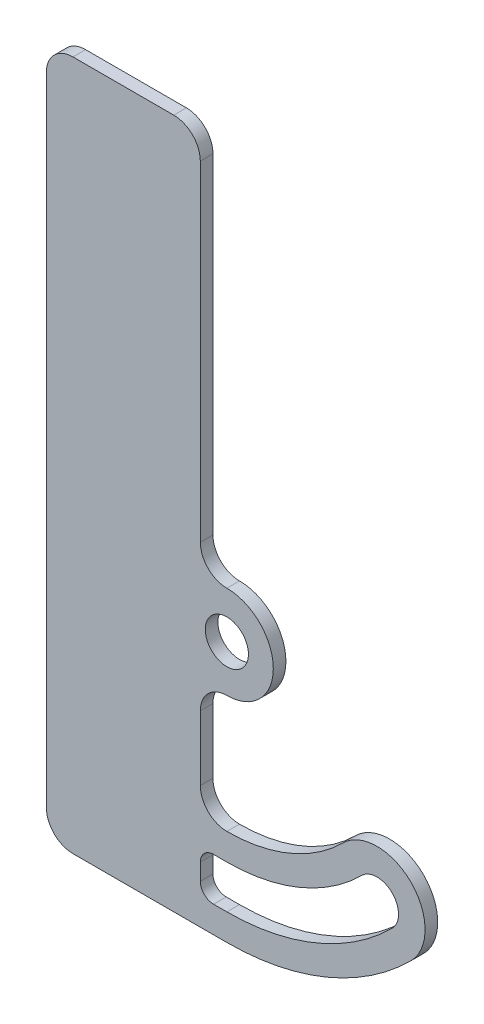
ISO-10303-21;
HEADER;
FILE_DESCRIPTION(('STEP AP214'),'2;1');
FILE_NAME('part.step','',(''),(''),'','','');
FILE_SCHEMA(('AUTOMOTIVE_DESIGN { 1 0 10303 214 1 1 1 1 }'));
ENDSEC;
DATA;
#1=APPLICATION_CONTEXT('core data for automotive mechanical design processes');
#2=APPLICATION_PROTOCOL_DEFINITION('international standard','automotive_design',2000,#1);
#3=PRODUCT_CONTEXT('',#1,'mechanical');
#4=PRODUCT('Part','Part','',(#3));
#5=PRODUCT_RELATED_PRODUCT_CATEGORY('part','',(#4));
#6=PRODUCT_DEFINITION_FORMATION('','',#4);
#7=PRODUCT_DEFINITION_CONTEXT('part definition',#1,'design');
#8=PRODUCT_DEFINITION('design','',#6,#7);
#9=PRODUCT_DEFINITION_SHAPE('','',#8);
#10=(LENGTH_UNIT() NAMED_UNIT(*) SI_UNIT(.MILLI.,.METRE.));
#11=(NAMED_UNIT(*) PLANE_ANGLE_UNIT() SI_UNIT($,.RADIAN.));
#12=(NAMED_UNIT(*) SI_UNIT($,.STERADIAN.) SOLID_ANGLE_UNIT());
#13=UNCERTAINTY_MEASURE_WITH_UNIT(LENGTH_MEASURE(1.E-05),#10,'distance_accuracy_value','');
#14=(GEOMETRIC_REPRESENTATION_CONTEXT(3) GLOBAL_UNCERTAINTY_ASSIGNED_CONTEXT((#13)) GLOBAL_UNIT_ASSIGNED_CONTEXT((#10,
#11,#12)) REPRESENTATION_CONTEXT('',''));
#15=CARTESIAN_POINT('',(0.,0.,0.));
#16=DIRECTION('',(0.,0.,1.));
#17=DIRECTION('',(1.,0.,0.));
#18=AXIS2_PLACEMENT_3D('',#15,#16,#17);
#19=CARTESIAN_POINT('',(40.005,13.49375,0.));
#20=DIRECTION('',(0.,0.,1.));
#21=DIRECTION('',(1.,0.,0.));
#22=AXIS2_PLACEMENT_3D('',#19,#20,#21);
#23=CYLINDRICAL_SURFACE('',#22,3.175);
#24=DIRECTION('',(0.,0.,-1.));
#25=VECTOR('',#24,1.);
#26=CARTESIAN_POINT('',(40.005,16.66875,0.));
#27=LINE('',#26,#25);
#28=CARTESIAN_POINT('',(40.005,16.66875,3.0226));
#29=VERTEX_POINT('',#28);
#30=CARTESIAN_POINT('',(40.005,16.66875,0.));
#31=VERTEX_POINT('',#30);
#32=EDGE_CURVE('E11',#29,#31,#27,.T.);
#33=ORIENTED_EDGE('',*,*,#32,.F.);
#34=CARTESIAN_POINT('',(40.005,13.49375,3.0226));
#35=DIRECTION('',(0.,0.,1.));
#36=DIRECTION('',(1.,0.,0.));
#37=AXIS2_PLACEMENT_3D('',#34,#35,#36);
#38=CIRCLE('',#37,3.175);
#39=CARTESIAN_POINT('',(36.83,13.49375,3.0226));
#40=VERTEX_POINT('',#39);
#41=EDGE_CURVE('E154',#29,#40,#38,.T.);
#42=ORIENTED_EDGE('',*,*,#41,.T.);
#43=DIRECTION('',(0.,0.,-1.));
#44=VECTOR('',#43,1.);
#45=CARTESIAN_POINT('',(36.83,13.49375,0.));
#46=LINE('',#45,#44);
#47=CARTESIAN_POINT('',(36.83,13.49375,0.));
#48=VERTEX_POINT('',#47);
#49=EDGE_CURVE('E51',#40,#48,#46,.T.);
#50=ORIENTED_EDGE('',*,*,#49,.T.);
#51=CARTESIAN_POINT('',(40.005,13.49375,0.));
#52=DIRECTION('',(0.,0.,1.));
#53=DIRECTION('',(1.,0.,0.));
#54=AXIS2_PLACEMENT_3D('',#51,#52,#53);
#55=CIRCLE('',#54,3.175);
#56=EDGE_CURVE('E243',#31,#48,#55,.T.);
#57=ORIENTED_EDGE('',*,*,#56,.F.);
#58=EDGE_LOOP('',(#33,#42,#50,#57));
#59=FACE_BOUND('',#58,.T.);
#60=ADVANCED_FACE('F41',(#59),#23,.F.);
#61=CARTESIAN_POINT('',(36.83,6.34999999999999,0.));
#62=DIRECTION('',(-1.,0.,0.));
#63=DIRECTION('',(0.,-1.,0.));
#64=AXIS2_PLACEMENT_3D('',#61,#62,#63);
#65=PLANE('',#64);
#66=ORIENTED_EDGE('',*,*,#49,.F.);
#67=DIRECTION('',(0.,1.,0.));
#68=VECTOR('',#67,1.);
#69=CARTESIAN_POINT('',(36.83,62.309375,3.0226));
#70=LINE('',#69,#68);
#71=CARTESIAN_POINT('',(36.83,9.52499999999998,3.0226));
#72=VERTEX_POINT('',#71);
#73=EDGE_CURVE('E178',#40,#72,#70,.F.);
#74=ORIENTED_EDGE('',*,*,#73,.T.);
#75=DIRECTION('',(0.,0.,-1.));
#76=VECTOR('',#75,1.);
#77=CARTESIAN_POINT('',(36.83,9.52499999999999,0.));
#78=LINE('',#77,#76);
#79=CARTESIAN_POINT('',(36.83,9.52499999999999,0.));
#80=VERTEX_POINT('',#79);
#81=EDGE_CURVE('E236',#72,#80,#78,.T.);
#82=ORIENTED_EDGE('',*,*,#81,.T.);
#83=DIRECTION('',(0.,-1.,0.));
#84=VECTOR('',#83,1.);
#85=CARTESIAN_POINT('',(36.83,6.34999999999999,0.));
#86=LINE('',#85,#84);
#87=EDGE_CURVE('E252',#48,#80,#86,.T.);
#88=ORIENTED_EDGE('',*,*,#87,.F.);
#89=EDGE_LOOP('',(#66,#74,#82,#88));
#90=FACE_BOUND('',#89,.T.);
#91=ADVANCED_FACE('F255',(#90),#65,.F.);
#92=CARTESIAN_POINT('',(40.005,9.52499999999999,0.));
#93=DIRECTION('',(0.,0.,1.));
#94=DIRECTION('',(1.,0.,0.));
#95=AXIS2_PLACEMENT_3D('',#92,#93,#94);
#96=CYLINDRICAL_SURFACE('',#95,3.175);
#97=ORIENTED_EDGE('',*,*,#81,.F.);
#98=CARTESIAN_POINT('',(40.005,9.52499999999999,3.0226));
#99=DIRECTION('',(0.,0.,1.));
#100=DIRECTION('',(1.,0.,0.));
#101=AXIS2_PLACEMENT_3D('',#98,#99,#100);
#102=CIRCLE('',#101,3.175);
#103=CARTESIAN_POINT('',(40.005,6.34999999999999,3.0226));
#104=VERTEX_POINT('',#103);
#105=EDGE_CURVE('E175',#72,#104,#102,.T.);
#106=ORIENTED_EDGE('',*,*,#105,.T.);
#107=DIRECTION('',(0.,0.,-1.));
#108=VECTOR('',#107,1.);
#109=CARTESIAN_POINT('',(40.005,6.34999999999999,0.));
#110=LINE('',#109,#108);
#111=CARTESIAN_POINT('',(40.005,6.34999999999999,0.));
#112=VERTEX_POINT('',#111);
#113=EDGE_CURVE('E233',#104,#112,#110,.T.);
#114=ORIENTED_EDGE('',*,*,#113,.T.);
#115=CARTESIAN_POINT('',(40.005,9.52499999999999,0.));
#116=DIRECTION('',(0.,0.,1.));
#117=DIRECTION('',(1.,0.,0.));
#118=AXIS2_PLACEMENT_3D('',#115,#116,#117);
#119=CIRCLE('',#118,3.175);
#120=EDGE_CURVE('E256',#80,#112,#119,.T.);
#121=ORIENTED_EDGE('',*,*,#120,.F.);
#122=EDGE_LOOP('',(#97,#106,#114,#121));
#123=FACE_BOUND('',#122,.T.);
#124=ADVANCED_FACE('F416',(#123),#96,.F.);
#125=CARTESIAN_POINT('',(36.83,6.34999999999999,0.));
#126=DIRECTION('',(0.,-1.,0.));
#127=DIRECTION('',(1.,0.,0.));
#128=AXIS2_PLACEMENT_3D('',#125,#126,#127);
#129=PLANE('',#128);
#130=ORIENTED_EDGE('',*,*,#113,.F.);
#131=DIRECTION('',(1.,0.,0.));
#132=VECTOR('',#131,1.);
#133=CARTESIAN_POINT('',(43.18,6.34999999999999,3.0226));
#134=LINE('',#133,#132);
#135=CARTESIAN_POINT('',(43.18,6.34999999999999,3.0226));
#136=VERTEX_POINT('',#135);
#137=EDGE_CURVE('E172',#104,#136,#134,.T.);
#138=ORIENTED_EDGE('',*,*,#137,.T.);
#139=DIRECTION('',(0.,0.,-1.));
#140=VECTOR('',#139,1.);
#141=CARTESIAN_POINT('',(43.18,6.34999999999999,0.));
#142=LINE('',#141,#140);
#143=CARTESIAN_POINT('',(43.18,6.34999999999999,0.));
#144=VERTEX_POINT('',#143);
#145=EDGE_CURVE('E230',#136,#144,#142,.T.);
#146=ORIENTED_EDGE('',*,*,#145,.T.);
#147=DIRECTION('',(1.,0.,0.));
#148=VECTOR('',#147,1.);
#149=CARTESIAN_POINT('',(36.83,6.34999999999999,0.));
#150=LINE('',#149,#148);
#151=EDGE_CURVE('E258',#112,#144,#150,.T.);
#152=ORIENTED_EDGE('',*,*,#151,.F.);
#153=EDGE_LOOP('',(#130,#138,#146,#152));
#154=FACE_BOUND('',#153,.T.);
#155=ADVANCED_FACE('F343',(#154),#129,.F.);
#156=CARTESIAN_POINT('',(43.18,62.309375,0.));
#157=DIRECTION('',(0.,0.,1.));
#158=DIRECTION('',(1.,0.,0.));
#159=AXIS2_PLACEMENT_3D('',#156,#157,#158);
#160=CYLINDRICAL_SURFACE('',#159,55.959375);
#161=ORIENTED_EDGE('',*,*,#145,.F.);
#162=CARTESIAN_POINT('',(43.18,62.309375,3.0226));
#163=DIRECTION('',(0.,0.,1.));
#164=DIRECTION('',(1.,0.,0.));
#165=AXIS2_PLACEMENT_3D('',#162,#163,#164);
#166=CIRCLE('',#165,55.959375);
#167=CARTESIAN_POINT('',(82.7492535334607,22.7401214665388,3.0226));
#168=VERTEX_POINT('',#167);
#169=EDGE_CURVE('E169',#136,#168,#166,.T.);
#170=ORIENTED_EDGE('',*,*,#169,.T.);
#171=DIRECTION('',(0.,0.,-1.));
#172=VECTOR('',#171,1.);
#173=CARTESIAN_POINT('',(82.7492535334607,22.7401214665388,0.));
#174=LINE('',#173,#172);
#175=CARTESIAN_POINT('',(82.7492535334607,22.7401214665388,0.));
#176=VERTEX_POINT('',#175);
#177=EDGE_CURVE('E228',#168,#176,#174,.T.);
#178=ORIENTED_EDGE('',*,*,#177,.T.);
#179=CARTESIAN_POINT('',(43.18,62.309375,0.));
#180=DIRECTION('',(0.,0.,1.));
#181=DIRECTION('',(1.,0.,0.));
#182=AXIS2_PLACEMENT_3D('',#179,#180,#181);
#183=CIRCLE('',#182,55.959375);
#184=EDGE_CURVE('E264',#144,#176,#183,.T.);
#185=ORIENTED_EDGE('',*,*,#184,.F.);
#186=EDGE_LOOP('',(#161,#170,#178,#185));
#187=FACE_BOUND('',#186,.T.);
#188=ADVANCED_FACE('F348',(#187),#160,.F.);
#189=CARTESIAN_POINT('',(79.1010244842764,26.3883505157232,0.));
#190=DIRECTION('',(0.,0.,1.));
#191=DIRECTION('',(1.,0.,0.));
#192=AXIS2_PLACEMENT_3D('',#189,#190,#191);
#193=CYLINDRICAL_SURFACE('',#192,5.159375);
#194=ORIENTED_EDGE('',*,*,#177,.F.);
#195=CARTESIAN_POINT('',(79.1010244842764,26.3883505157232,3.0226));
#196=DIRECTION('',(0.,0.,1.));
#197=DIRECTION('',(1.,0.,0.));
#198=AXIS2_PLACEMENT_3D('',#195,#196,#197);
#199=CIRCLE('',#198,5.159375);
#200=CARTESIAN_POINT('',(75.4527954350921,30.0365795649076,3.0226));
#201=VERTEX_POINT('',#200);
#202=EDGE_CURVE('E166',#168,#201,#199,.T.);
#203=ORIENTED_EDGE('',*,*,#202,.T.);
#204=DIRECTION('',(0.,0.,-1.));
#205=VECTOR('',#204,1.);
#206=CARTESIAN_POINT('',(75.4527954350921,30.0365795649076,0.));
#207=LINE('',#206,#205);
#208=CARTESIAN_POINT('',(75.4527954350921,30.0365795649076,0.));
#209=VERTEX_POINT('',#208);
#210=EDGE_CURVE('E59',#201,#209,#207,.T.);
#211=ORIENTED_EDGE('',*,*,#210,.T.);
#212=CARTESIAN_POINT('',(79.1010244842764,26.3883505157232,0.));
#213=DIRECTION('',(0.,0.,1.));
#214=DIRECTION('',(1.,0.,0.));
#215=AXIS2_PLACEMENT_3D('',#212,#213,#214);
#216=CIRCLE('',#215,5.159375);
#217=EDGE_CURVE('E226',#176,#209,#216,.T.);
#218=ORIENTED_EDGE('',*,*,#217,.F.);
#219=EDGE_LOOP('',(#194,#203,#211,#218));
#220=FACE_BOUND('',#219,.T.);
#221=ADVANCED_FACE('F349',(#220),#193,.F.);
#222=CARTESIAN_POINT('',(43.18,62.309375,0.));
#223=DIRECTION('',(0.,0.,1.));
#224=DIRECTION('',(1.,0.,0.));
#225=AXIS2_PLACEMENT_3D('',#222,#223,#224);
#226=CYLINDRICAL_SURFACE('',#225,45.640625);
#227=ORIENTED_EDGE('',*,*,#210,.F.);
#228=CARTESIAN_POINT('',(43.18,62.309375,3.0226));
#229=DIRECTION('',(0.,0.,-1.));
#230=DIRECTION('',(-1.,0.,0.));
#231=AXIS2_PLACEMENT_3D('',#228,#229,#230);
#232=CIRCLE('',#231,45.640625);
#233=CARTESIAN_POINT('',(43.18,16.66875,3.0226));
#234=VERTEX_POINT('',#233);
#235=EDGE_CURVE('E152',#201,#234,#232,.T.);
#236=ORIENTED_EDGE('',*,*,#235,.T.);
#237=DIRECTION('',(0.,0.,-1.));
#238=VECTOR('',#237,1.);
#239=CARTESIAN_POINT('',(43.18,16.66875,0.));
#240=LINE('',#239,#238);
#241=CARTESIAN_POINT('',(43.18,16.66875,0.));
#242=VERTEX_POINT('',#241);
#243=EDGE_CURVE('E45',#234,#242,#240,.T.);
#244=ORIENTED_EDGE('',*,*,#243,.T.);
#245=CARTESIAN_POINT('',(43.18,62.309375,0.));
#246=DIRECTION('',(0.,0.,-1.));
#247=DIRECTION('',(1.,0.,0.));
#248=AXIS2_PLACEMENT_3D('',#245,#246,#247);
#249=CIRCLE('',#248,45.640625);
#250=EDGE_CURVE('E350',#209,#242,#249,.T.);
#251=ORIENTED_EDGE('',*,*,#250,.F.);
#252=EDGE_LOOP('',(#227,#236,#244,#251));
#253=FACE_BOUND('',#252,.T.);
#254=ADVANCED_FACE('F156',(#253),#226,.T.);
#255=CARTESIAN_POINT('',(36.83,73.421875,0.));
#256=DIRECTION('',(1.,0.,0.));
#257=DIRECTION('',(0.,1.,0.));
#258=AXIS2_PLACEMENT_3D('',#255,#256,#257);
#259=PLANE('',#258);
#260=DIRECTION('',(0.,0.,-1.));
#261=VECTOR('',#260,1.);
#262=CARTESIAN_POINT('',(36.83,158.75,0.));
#263=LINE('',#262,#261);
#264=CARTESIAN_POINT('',(36.83,158.75,3.0226));
#265=VERTEX_POINT('',#264);
#266=CARTESIAN_POINT('',(36.83,158.75,0.));
#267=VERTEX_POINT('',#266);
#268=EDGE_CURVE('E147',#265,#267,#263,.T.);
#269=ORIENTED_EDGE('',*,*,#268,.F.);
#270=DIRECTION('',(0.,1.,0.));
#271=VECTOR('',#270,1.);
#272=CARTESIAN_POINT('',(36.83,62.309375,3.0226));
#273=LINE('',#272,#271);
#274=CARTESIAN_POINT('',(36.83,79.771875,3.0226));
#275=VERTEX_POINT('',#274);
#276=EDGE_CURVE('E306',#275,#265,#273,.T.);
#277=ORIENTED_EDGE('',*,*,#276,.F.);
#278=DIRECTION('',(0.,0.,-1.));
#279=VECTOR('',#278,1.);
#280=CARTESIAN_POINT('',(36.83,79.771875,0.));
#281=LINE('',#280,#279);
#282=CARTESIAN_POINT('',(36.83,79.771875,0.));
#283=VERTEX_POINT('',#282);
#284=EDGE_CURVE('E219',#275,#283,#281,.T.);
#285=ORIENTED_EDGE('',*,*,#284,.T.);
#286=DIRECTION('',(0.,1.,0.));
#287=VECTOR('',#286,1.);
#288=CARTESIAN_POINT('',(36.83,73.421875,0.));
#289=LINE('',#288,#287);
#290=EDGE_CURVE('E387',#283,#267,#289,.T.);
#291=ORIENTED_EDGE('',*,*,#290,.T.);
#292=EDGE_LOOP('',(#269,#277,#285,#291));
#293=FACE_BOUND('',#292,.T.);
#294=ADVANCED_FACE('F430',(#293),#259,.T.);
#295=CARTESIAN_POINT('',(43.18,79.771875,0.));
#296=DIRECTION('',(0.,0.,1.));
#297=DIRECTION('',(1.,0.,0.));
#298=AXIS2_PLACEMENT_3D('',#295,#296,#297);
#299=CYLINDRICAL_SURFACE('',#298,6.35);
#300=ORIENTED_EDGE('',*,*,#284,.F.);
#301=CARTESIAN_POINT('',(43.18,79.771875,3.0226));
#302=DIRECTION('',(0.,0.,1.));
#303=DIRECTION('',(1.,0.,0.));
#304=AXIS2_PLACEMENT_3D('',#301,#302,#303);
#305=CIRCLE('',#304,6.35);
#306=CARTESIAN_POINT('',(43.18,73.421875,3.0226));
#307=VERTEX_POINT('',#306);
#308=EDGE_CURVE('E304',#275,#307,#305,.T.);
#309=ORIENTED_EDGE('',*,*,#308,.T.);
#310=DIRECTION('',(0.,0.,-1.));
#311=VECTOR('',#310,1.);
#312=CARTESIAN_POINT('',(43.18,73.421875,0.));
#313=LINE('',#312,#311);
#314=CARTESIAN_POINT('',(43.18,73.421875,0.));
#315=VERTEX_POINT('',#314);
#316=EDGE_CURVE('E216',#307,#315,#313,.T.);
#317=ORIENTED_EDGE('',*,*,#316,.T.);
#318=CARTESIAN_POINT('',(43.18,79.771875,0.));
#319=DIRECTION('',(0.,0.,1.));
#320=DIRECTION('',(1.,0.,0.));
#321=AXIS2_PLACEMENT_3D('',#318,#319,#320);
#322=CIRCLE('',#321,6.35);
#323=EDGE_CURVE('E384',#283,#315,#322,.T.);
#324=ORIENTED_EDGE('',*,*,#323,.F.);
#325=EDGE_LOOP('',(#300,#309,#317,#324));
#326=FACE_BOUND('',#325,.T.);
#327=ADVANCED_FACE('F435',(#326),#299,.F.);
#328=CARTESIAN_POINT('',(43.18,62.309375,0.));
#329=DIRECTION('',(0.,0.,1.));
#330=DIRECTION('',(1.,0.,0.));
#331=AXIS2_PLACEMENT_3D('',#328,#329,#330);
#332=CYLINDRICAL_SURFACE('',#331,11.1125);
#333=ORIENTED_EDGE('',*,*,#316,.F.);
#334=CARTESIAN_POINT('',(43.18,62.309375,3.0226));
#335=DIRECTION('',(0.,0.,1.));
#336=DIRECTION('',(1.,0.,0.));
#337=AXIS2_PLACEMENT_3D('',#334,#335,#336);
#338=CIRCLE('',#337,11.1125);
#339=CARTESIAN_POINT('',(43.18,51.196875,3.0226));
#340=VERTEX_POINT('',#339);
#341=EDGE_CURVE('E301',#340,#307,#338,.T.);
#342=ORIENTED_EDGE('',*,*,#341,.F.);
#343=DIRECTION('',(0.,0.,-1.));
#344=VECTOR('',#343,1.);
#345=CARTESIAN_POINT('',(43.18,51.196875,0.));
#346=LINE('',#345,#344);
#347=CARTESIAN_POINT('',(43.18,51.196875,0.));
#348=VERTEX_POINT('',#347);
#349=EDGE_CURVE('E213',#340,#348,#346,.T.);
#350=ORIENTED_EDGE('',*,*,#349,.T.);
#351=CARTESIAN_POINT('',(43.18,62.309375,0.));
#352=DIRECTION('',(0.,0.,1.));
#353=DIRECTION('',(1.,0.,0.));
#354=AXIS2_PLACEMENT_3D('',#351,#352,#353);
#355=CIRCLE('',#354,11.1125);
#356=EDGE_CURVE('E381',#348,#315,#355,.T.);
#357=ORIENTED_EDGE('',*,*,#356,.T.);
#358=EDGE_LOOP('',(#333,#342,#350,#357));
#359=FACE_BOUND('',#358,.T.);
#360=ADVANCED_FACE('F439',(#359),#332,.T.);
#361=CARTESIAN_POINT('',(43.18,44.846875,0.));
#362=DIRECTION('',(0.,0.,1.));
#363=DIRECTION('',(1.,0.,0.));
#364=AXIS2_PLACEMENT_3D('',#361,#362,#363);
#365=CYLINDRICAL_SURFACE('',#364,6.35);
#366=ORIENTED_EDGE('',*,*,#349,.F.);
#367=CARTESIAN_POINT('',(43.18,44.846875,3.0226));
#368=DIRECTION('',(0.,0.,1.));
#369=DIRECTION('',(1.,0.,0.));
#370=AXIS2_PLACEMENT_3D('',#367,#368,#369);
#371=CIRCLE('',#370,6.35);
#372=CARTESIAN_POINT('',(36.83,44.846875,3.0226));
#373=VERTEX_POINT('',#372);
#374=EDGE_CURVE('E298',#340,#373,#371,.T.);
#375=ORIENTED_EDGE('',*,*,#374,.T.);
#376=DIRECTION('',(0.,0.,-1.));
#377=VECTOR('',#376,1.);
#378=CARTESIAN_POINT('',(36.83,44.846875,0.));
#379=LINE('',#378,#377);
#380=CARTESIAN_POINT('',(36.83,44.846875,0.));
#381=VERTEX_POINT('',#380);
#382=EDGE_CURVE('E210',#373,#381,#379,.T.);
#383=ORIENTED_EDGE('',*,*,#382,.T.);
#384=CARTESIAN_POINT('',(43.18,44.846875,0.));
#385=DIRECTION('',(0.,0.,1.));
#386=DIRECTION('',(1.,0.,0.));
#387=AXIS2_PLACEMENT_3D('',#384,#385,#386);
#388=CIRCLE('',#387,6.35);
#389=EDGE_CURVE('E378',#348,#381,#388,.T.);
#390=ORIENTED_EDGE('',*,*,#389,.F.);
#391=EDGE_LOOP('',(#366,#375,#383,#390));
#392=FACE_BOUND('',#391,.T.);
#393=ADVANCED_FACE('F443',(#392),#365,.F.);
#394=CARTESIAN_POINT('',(36.83,23.01875,0.));
#395=DIRECTION('',(1.,0.,0.));
#396=DIRECTION('',(0.,1.,0.));
#397=AXIS2_PLACEMENT_3D('',#394,#395,#396);
#398=PLANE('',#397);
#399=ORIENTED_EDGE('',*,*,#382,.F.);
#400=DIRECTION('',(0.,1.,0.));
#401=VECTOR('',#400,1.);
#402=CARTESIAN_POINT('',(36.83,62.309375,3.0226));
#403=LINE('',#402,#401);
#404=CARTESIAN_POINT('',(36.83,29.36875,3.0226));
#405=VERTEX_POINT('',#404);
#406=EDGE_CURVE('E295',#405,#373,#403,.T.);
#407=ORIENTED_EDGE('',*,*,#406,.F.);
#408=DIRECTION('',(0.,0.,-1.));
#409=VECTOR('',#408,1.);
#410=CARTESIAN_POINT('',(36.83,29.36875,0.));
#411=LINE('',#410,#409);
#412=CARTESIAN_POINT('',(36.83,29.36875,0.));
#413=VERTEX_POINT('',#412);
#414=EDGE_CURVE('E207',#405,#413,#411,.T.);
#415=ORIENTED_EDGE('',*,*,#414,.T.);
#416=DIRECTION('',(0.,1.,0.));
#417=VECTOR('',#416,1.);
#418=CARTESIAN_POINT('',(36.83,23.01875,0.));
#419=LINE('',#418,#417);
#420=EDGE_CURVE('E375',#413,#381,#419,.T.);
#421=ORIENTED_EDGE('',*,*,#420,.T.);
#422=EDGE_LOOP('',(#399,#407,#415,#421));
#423=FACE_BOUND('',#422,.T.);
#424=ADVANCED_FACE('F447',(#423),#398,.T.);
#425=CARTESIAN_POINT('',(43.18,29.36875,0.));
#426=DIRECTION('',(0.,0.,1.));
#427=DIRECTION('',(1.,0.,0.));
#428=AXIS2_PLACEMENT_3D('',#425,#426,#427);
#429=CYLINDRICAL_SURFACE('',#428,6.35);
#430=ORIENTED_EDGE('',*,*,#414,.F.);
#431=CARTESIAN_POINT('',(43.18,29.36875,3.0226));
#432=DIRECTION('',(0.,0.,1.));
#433=DIRECTION('',(1.,0.,0.));
#434=AXIS2_PLACEMENT_3D('',#431,#432,#433);
#435=CIRCLE('',#434,6.35);
#436=CARTESIAN_POINT('',(43.18,23.01875,3.0226));
#437=VERTEX_POINT('',#436);
#438=EDGE_CURVE('E292',#405,#437,#435,.T.);
#439=ORIENTED_EDGE('',*,*,#438,.T.);
#440=DIRECTION('',(0.,0.,-1.));
#441=VECTOR('',#440,1.);
#442=CARTESIAN_POINT('',(43.18,23.01875,0.));
#443=LINE('',#442,#441);
#444=CARTESIAN_POINT('',(43.18,23.01875,0.));
#445=VERTEX_POINT('',#444);
#446=EDGE_CURVE('E204',#437,#445,#443,.T.);
#447=ORIENTED_EDGE('',*,*,#446,.T.);
#448=CARTESIAN_POINT('',(43.18,29.36875,0.));
#449=DIRECTION('',(0.,0.,1.));
#450=DIRECTION('',(1.,0.,0.));
#451=AXIS2_PLACEMENT_3D('',#448,#449,#450);
#452=CIRCLE('',#451,6.35);
#453=EDGE_CURVE('E372',#413,#445,#452,.T.);
#454=ORIENTED_EDGE('',*,*,#453,.F.);
#455=EDGE_LOOP('',(#430,#439,#447,#454));
#456=FACE_BOUND('',#455,.T.);
#457=ADVANCED_FACE('F451',(#456),#429,.F.);
#458=CARTESIAN_POINT('',(43.18,62.309375,0.));
#459=DIRECTION('',(0.,0.,1.));
#460=DIRECTION('',(1.,0.,0.));
#461=AXIS2_PLACEMENT_3D('',#458,#459,#460);
#462=CYLINDRICAL_SURFACE('',#461,39.290625);
#463=ORIENTED_EDGE('',*,*,#446,.F.);
#464=CARTESIAN_POINT('',(43.18,62.309375,3.0226));
#465=DIRECTION('',(0.,0.,-1.));
#466=DIRECTION('',(-1.,0.,0.));
#467=AXIS2_PLACEMENT_3D('',#464,#465,#466);
#468=CIRCLE('',#467,39.290625);
#469=CARTESIAN_POINT('',(70.9626673745575,34.5267076254421,3.0226));
#470=VERTEX_POINT('',#469);
#471=EDGE_CURVE('E289',#470,#437,#468,.T.);
#472=ORIENTED_EDGE('',*,*,#471,.F.);
#473=DIRECTION('',(0.,0.,-1.));
#474=VECTOR('',#473,1.);
#475=CARTESIAN_POINT('',(70.9626673745575,34.5267076254421,0.));
#476=LINE('',#475,#474);
#477=CARTESIAN_POINT('',(70.9626673745575,34.5267076254421,0.));
#478=VERTEX_POINT('',#477);
#479=EDGE_CURVE('E201',#470,#478,#476,.T.);
#480=ORIENTED_EDGE('',*,*,#479,.T.);
#481=CARTESIAN_POINT('',(43.18,62.309375,0.));
#482=DIRECTION('',(0.,0.,-1.));
#483=DIRECTION('',(1.,0.,0.));
#484=AXIS2_PLACEMENT_3D('',#481,#482,#483);
#485=CIRCLE('',#484,39.290625);
#486=EDGE_CURVE('E369',#478,#445,#485,.T.);
#487=ORIENTED_EDGE('',*,*,#486,.T.);
#488=EDGE_LOOP('',(#463,#472,#480,#487));
#489=FACE_BOUND('',#488,.T.);
#490=ADVANCED_FACE('F455',(#489),#462,.F.);
#491=CARTESIAN_POINT('',(79.1010244842764,26.3883505157232,0.));
#492=DIRECTION('',(0.,0.,1.));
#493=DIRECTION('',(1.,0.,0.));
#494=AXIS2_PLACEMENT_3D('',#491,#492,#493);
#495=CYLINDRICAL_SURFACE('',#494,11.509375);
#496=ORIENTED_EDGE('',*,*,#479,.F.);
#497=CARTESIAN_POINT('',(79.1010244842764,26.3883505157232,3.0226));
#498=DIRECTION('',(0.,0.,1.));
#499=DIRECTION('',(1.,0.,0.));
#500=AXIS2_PLACEMENT_3D('',#497,#498,#499);
#501=CIRCLE('',#500,11.509375);
#502=CARTESIAN_POINT('',(87.2393815939953,18.2499934060042,3.0226));
#503=VERTEX_POINT('',#502);
#504=EDGE_CURVE('E286',#503,#470,#501,.T.);
#505=ORIENTED_EDGE('',*,*,#504,.F.);
#506=DIRECTION('',(0.,0.,-1.));
#507=VECTOR('',#506,1.);
#508=CARTESIAN_POINT('',(87.2393815939953,18.2499934060042,0.));
#509=LINE('',#508,#507);
#510=CARTESIAN_POINT('',(87.2393815939953,18.2499934060042,0.));
#511=VERTEX_POINT('',#510);
#512=EDGE_CURVE('E198',#503,#511,#509,.T.);
#513=ORIENTED_EDGE('',*,*,#512,.T.);
#514=CARTESIAN_POINT('',(79.1010244842764,26.3883505157232,0.));
#515=DIRECTION('',(0.,0.,1.));
#516=DIRECTION('',(1.,0.,0.));
#517=AXIS2_PLACEMENT_3D('',#514,#515,#516);
#518=CIRCLE('',#517,11.509375);
#519=EDGE_CURVE('E366',#511,#478,#518,.T.);
#520=ORIENTED_EDGE('',*,*,#519,.T.);
#521=EDGE_LOOP('',(#496,#505,#513,#520));
#522=FACE_BOUND('',#521,.T.);
#523=ADVANCED_FACE('F459',(#522),#495,.T.);
#524=CARTESIAN_POINT('',(43.18,62.309375,0.));
#525=DIRECTION('',(0.,0.,1.));
#526=DIRECTION('',(1.,0.,0.));
#527=AXIS2_PLACEMENT_3D('',#524,#525,#526);
#528=CYLINDRICAL_SURFACE('',#527,62.309375);
#529=ORIENTED_EDGE('',*,*,#512,.F.);
#530=CARTESIAN_POINT('',(43.18,62.309375,3.0226));
#531=DIRECTION('',(0.,0.,1.));
#532=DIRECTION('',(1.,0.,0.));
#533=AXIS2_PLACEMENT_3D('',#530,#531,#532);
#534=CIRCLE('',#533,62.309375);
#535=CARTESIAN_POINT('',(43.18,0.,3.0226));
#536=VERTEX_POINT('',#535);
#537=EDGE_CURVE('E283',#536,#503,#534,.T.);
#538=ORIENTED_EDGE('',*,*,#537,.F.);
#539=DIRECTION('',(0.,0.,-1.));
#540=VECTOR('',#539,1.);
#541=CARTESIAN_POINT('',(43.18,0.,0.));
#542=LINE('',#541,#540);
#543=CARTESIAN_POINT('',(43.18,0.,0.));
#544=VERTEX_POINT('',#543);
#545=EDGE_CURVE('E195',#536,#544,#542,.T.);
#546=ORIENTED_EDGE('',*,*,#545,.T.);
#547=CARTESIAN_POINT('',(43.18,62.309375,0.));
#548=DIRECTION('',(0.,0.,1.));
#549=DIRECTION('',(1.,0.,0.));
#550=AXIS2_PLACEMENT_3D('',#547,#548,#549);
#551=CIRCLE('',#550,62.309375);
#552=EDGE_CURVE('E363',#544,#511,#551,.T.);
#553=ORIENTED_EDGE('',*,*,#552,.T.);
#554=EDGE_LOOP('',(#529,#538,#546,#553));
#555=FACE_BOUND('',#554,.T.);
#556=ADVANCED_FACE('F463',(#555),#528,.T.);
#557=CARTESIAN_POINT('',(0.,0.,0.));
#558=DIRECTION('',(0.,-1.,0.));
#559=DIRECTION('',(1.,0.,0.));
#560=AXIS2_PLACEMENT_3D('',#557,#558,#559);
#561=PLANE('',#560);
#562=ORIENTED_EDGE('',*,*,#545,.F.);
#563=DIRECTION('',(1.,0.,0.));
#564=VECTOR('',#563,1.);
#565=CARTESIAN_POINT('',(43.18,0.,3.0226));
#566=LINE('',#565,#564);
#567=CARTESIAN_POINT('',(6.35,0.,3.0226));
#568=VERTEX_POINT('',#567);
#569=EDGE_CURVE('E280',#568,#536,#566,.T.);
#570=ORIENTED_EDGE('',*,*,#569,.F.);
#571=DIRECTION('',(0.,0.,-1.));
#572=VECTOR('',#571,1.);
#573=CARTESIAN_POINT('',(6.35,0.,0.));
#574=LINE('',#573,#572);
#575=CARTESIAN_POINT('',(6.35,0.,0.));
#576=VERTEX_POINT('',#575);
#577=EDGE_CURVE('E192',#568,#576,#574,.T.);
#578=ORIENTED_EDGE('',*,*,#577,.T.);
#579=DIRECTION('',(1.,0.,0.));
#580=VECTOR('',#579,1.);
#581=CARTESIAN_POINT('',(0.,0.,0.));
#582=LINE('',#581,#580);
#583=EDGE_CURVE('E360',#576,#544,#582,.T.);
#584=ORIENTED_EDGE('',*,*,#583,.T.);
#585=EDGE_LOOP('',(#562,#570,#578,#584));
#586=FACE_BOUND('',#585,.T.);
#587=ADVANCED_FACE('F467',(#586),#561,.T.);
#588=CARTESIAN_POINT('',(6.35,6.35,0.));
#589=DIRECTION('',(0.,0.,1.));
#590=DIRECTION('',(1.,0.,0.));
#591=AXIS2_PLACEMENT_3D('',#588,#589,#590);
#592=CYLINDRICAL_SURFACE('',#591,6.35);
#593=ORIENTED_EDGE('',*,*,#577,.F.);
#594=CARTESIAN_POINT('',(6.35,6.35,3.0226));
#595=DIRECTION('',(0.,0.,1.));
#596=DIRECTION('',(1.,0.,0.));
#597=AXIS2_PLACEMENT_3D('',#594,#595,#596);
#598=CIRCLE('',#597,6.35);
#599=CARTESIAN_POINT('',(0.,6.35,3.0226));
#600=VERTEX_POINT('',#599);
#601=EDGE_CURVE('E277',#568,#600,#598,.F.);
#602=ORIENTED_EDGE('',*,*,#601,.T.);
#603=DIRECTION('',(0.,0.,-1.));
#604=VECTOR('',#603,1.);
#605=CARTESIAN_POINT('',(0.,6.35,0.));
#606=LINE('',#605,#604);
#607=CARTESIAN_POINT('',(0.,6.35,0.));
#608=VERTEX_POINT('',#607);
#609=EDGE_CURVE('E189',#600,#608,#606,.T.);
#610=ORIENTED_EDGE('',*,*,#609,.T.);
#611=CARTESIAN_POINT('',(6.35,6.35,0.));
#612=DIRECTION('',(0.,0.,1.));
#613=DIRECTION('',(1.,0.,0.));
#614=AXIS2_PLACEMENT_3D('',#611,#612,#613);
#615=CIRCLE('',#614,6.35);
#616=EDGE_CURVE('E357',#576,#608,#615,.F.);
#617=ORIENTED_EDGE('',*,*,#616,.F.);
#618=EDGE_LOOP('',(#593,#602,#610,#617));
#619=FACE_BOUND('',#618,.T.);
#620=ADVANCED_FACE('F471',(#619),#592,.T.);
#621=CARTESIAN_POINT('',(0.,0.,0.));
#622=DIRECTION('',(-1.,0.,0.));
#623=DIRECTION('',(0.,-1.,0.));
#624=AXIS2_PLACEMENT_3D('',#621,#622,#623);
#625=PLANE('',#624);
#626=ORIENTED_EDGE('',*,*,#609,.F.);
#627=DIRECTION('',(0.,1.,0.));
#628=VECTOR('',#627,1.);
#629=CARTESIAN_POINT('',(0.,62.309375,3.0226));
#630=LINE('',#629,#628);
#631=CARTESIAN_POINT('',(0.,158.75,3.0226));
#632=VERTEX_POINT('',#631);
#633=EDGE_CURVE('E160',#632,#600,#630,.F.);
#634=ORIENTED_EDGE('',*,*,#633,.F.);
#635=DIRECTION('',(0.,0.,-1.));
#636=VECTOR('',#635,1.);
#637=CARTESIAN_POINT('',(0.,158.75,0.));
#638=LINE('',#637,#636);
#639=CARTESIAN_POINT('',(0.,158.75,0.));
#640=VERTEX_POINT('',#639);
#641=EDGE_CURVE('E185',#632,#640,#638,.T.);
#642=ORIENTED_EDGE('',*,*,#641,.T.);
#643=DIRECTION('',(0.,-1.,0.));
#644=VECTOR('',#643,1.);
#645=CARTESIAN_POINT('',(0.,0.,0.));
#646=LINE('',#645,#644);
#647=EDGE_CURVE('E352',#640,#608,#646,.T.);
#648=ORIENTED_EDGE('',*,*,#647,.T.);
#649=EDGE_LOOP('',(#626,#634,#642,#648));
#650=FACE_BOUND('',#649,.T.);
#651=ADVANCED_FACE('F475',(#650),#625,.T.);
#652=CARTESIAN_POINT('',(6.35,158.75,0.));
#653=DIRECTION('',(0.,0.,1.));
#654=DIRECTION('',(1.,0.,0.));
#655=AXIS2_PLACEMENT_3D('',#652,#653,#654);
#656=CYLINDRICAL_SURFACE('',#655,6.35);
#657=ORIENTED_EDGE('',*,*,#641,.F.);
#658=CARTESIAN_POINT('',(6.35,158.75,3.0226));
#659=DIRECTION('',(0.,0.,1.));
#660=DIRECTION('',(1.,0.,0.));
#661=AXIS2_PLACEMENT_3D('',#658,#659,#660);
#662=CIRCLE('',#661,6.35);
#663=CARTESIAN_POINT('',(6.35,165.1,3.0226));
#664=VERTEX_POINT('',#663);
#665=EDGE_CURVE('E157',#632,#664,#662,.F.);
#666=ORIENTED_EDGE('',*,*,#665,.T.);
#667=DIRECTION('',(0.,0.,-1.));
#668=VECTOR('',#667,1.);
#669=CARTESIAN_POINT('',(6.35,165.1,0.));
#670=LINE('',#669,#668);
#671=CARTESIAN_POINT('',(6.35,165.1,0.));
#672=VERTEX_POINT('',#671);
#673=EDGE_CURVE('E182',#664,#672,#670,.T.);
#674=ORIENTED_EDGE('',*,*,#673,.T.);
#675=CARTESIAN_POINT('',(6.35,158.75,0.));
#676=DIRECTION('',(0.,0.,1.));
#677=DIRECTION('',(1.,0.,0.));
#678=AXIS2_PLACEMENT_3D('',#675,#676,#677);
#679=CIRCLE('',#678,6.35);
#680=EDGE_CURVE('E331',#640,#672,#679,.F.);
#681=ORIENTED_EDGE('',*,*,#680,.F.);
#682=EDGE_LOOP('',(#657,#666,#674,#681));
#683=FACE_BOUND('',#682,.T.);
#684=ADVANCED_FACE('F329',(#683),#656,.T.);
#685=CARTESIAN_POINT('',(0.,165.1,0.));
#686=DIRECTION('',(0.,1.,0.));
#687=DIRECTION('',(-1.,0.,0.));
#688=AXIS2_PLACEMENT_3D('',#685,#686,#687);
#689=PLANE('',#688);
#690=ORIENTED_EDGE('',*,*,#673,.F.);
#691=DIRECTION('',(1.,0.,0.));
#692=VECTOR('',#691,1.);
#693=CARTESIAN_POINT('',(43.18,165.1,3.0226));
#694=LINE('',#693,#692);
#695=CARTESIAN_POINT('',(30.48,165.1,3.0226));
#696=VERTEX_POINT('',#695);
#697=EDGE_CURVE('E272',#696,#664,#694,.F.);
#698=ORIENTED_EDGE('',*,*,#697,.F.);
#699=DIRECTION('',(0.,0.,-1.));
#700=VECTOR('',#699,1.);
#701=CARTESIAN_POINT('',(30.48,165.1,0.));
#702=LINE('',#701,#700);
#703=CARTESIAN_POINT('',(30.48,165.1,0.));
#704=VERTEX_POINT('',#703);
#705=EDGE_CURVE('E186',#696,#704,#702,.T.);
#706=ORIENTED_EDGE('',*,*,#705,.T.);
#707=DIRECTION('',(-1.,0.,0.));
#708=VECTOR('',#707,1.);
#709=CARTESIAN_POINT('',(0.,165.1,0.));
#710=LINE('',#709,#708);
#711=EDGE_CURVE('E325',#704,#672,#710,.T.);
#712=ORIENTED_EDGE('',*,*,#711,.T.);
#713=EDGE_LOOP('',(#690,#698,#706,#712));
#714=FACE_BOUND('',#713,.T.);
#715=ADVANCED_FACE('F321',(#714),#689,.T.);
#716=CARTESIAN_POINT('',(43.18,62.309375,0.));
#717=DIRECTION('',(0.,0.,1.));
#718=DIRECTION('',(1.,0.,0.));
#719=AXIS2_PLACEMENT_3D('',#716,#717,#718);
#720=CYLINDRICAL_SURFACE('',#719,5.159375);
#721=CARTESIAN_POINT('',(43.18,62.309375,0.));
#722=DIRECTION('',(0.,0.,1.));
#723=DIRECTION('',(1.,0.,0.));
#724=AXIS2_PLACEMENT_3D('',#721,#722,#723);
#725=CIRCLE('',#724,5.159375);
#726=CARTESIAN_POINT('',(48.339375,62.309375,0.));
#727=VERTEX_POINT('',#726);
#728=EDGE_CURVE('E168',#727,#727,#725,.T.);
#729=ORIENTED_EDGE('',*,*,#728,.F.);
#730=EDGE_LOOP('',(#729));
#731=FACE_BOUND('',#730,.T.);
#732=CARTESIAN_POINT('',(43.18,62.309375,3.0226));
#733=DIRECTION('',(0.,0.,1.));
#734=DIRECTION('',(1.,0.,0.));
#735=AXIS2_PLACEMENT_3D('',#732,#733,#734);
#736=CIRCLE('',#735,5.159375);
#737=CARTESIAN_POINT('',(48.339375,62.309375,3.0226));
#738=VERTEX_POINT('',#737);
#739=EDGE_CURVE('E269',#738,#738,#736,.T.);
#740=ORIENTED_EDGE('',*,*,#739,.T.);
#741=EDGE_LOOP('',(#740));
#742=FACE_BOUND('',#741,.T.);
#743=ADVANCED_FACE('F398',(#731,#742),#720,.F.);
#744=CARTESIAN_POINT('',(30.48,158.75,0.));
#745=DIRECTION('',(0.,0.,1.));
#746=DIRECTION('',(1.,0.,0.));
#747=AXIS2_PLACEMENT_3D('',#744,#745,#746);
#748=CYLINDRICAL_SURFACE('',#747,6.35);
#749=CARTESIAN_POINT('',(30.48,158.75,3.0226));
#750=DIRECTION('',(0.,0.,1.));
#751=DIRECTION('',(1.,0.,0.));
#752=AXIS2_PLACEMENT_3D('',#749,#750,#751);
#753=CIRCLE('',#752,6.35);
#754=EDGE_CURVE('E164',#696,#265,#753,.F.);
#755=ORIENTED_EDGE('',*,*,#754,.T.);
#756=ORIENTED_EDGE('',*,*,#268,.T.);
#757=CARTESIAN_POINT('',(30.48,158.75,0.));
#758=DIRECTION('',(0.,0.,1.));
#759=DIRECTION('',(1.,0.,0.));
#760=AXIS2_PLACEMENT_3D('',#757,#758,#759);
#761=CIRCLE('',#760,6.35);
#762=EDGE_CURVE('E390',#704,#267,#761,.F.);
#763=ORIENTED_EDGE('',*,*,#762,.F.);
#764=ORIENTED_EDGE('',*,*,#705,.F.);
#765=EDGE_LOOP('',(#755,#756,#763,#764));
#766=FACE_BOUND('',#765,.T.);
#767=ADVANCED_FACE('F314',(#766),#748,.T.);
#768=CARTESIAN_POINT('',(36.83,16.66875,0.));
#769=DIRECTION('',(0.,1.,0.));
#770=DIRECTION('',(-1.,0.,0.));
#771=AXIS2_PLACEMENT_3D('',#768,#769,#770);
#772=PLANE('',#771);
#773=DIRECTION('',(1.,0.,0.));
#774=VECTOR('',#773,1.);
#775=CARTESIAN_POINT('',(43.18,16.66875,3.0226));
#776=LINE('',#775,#774);
#777=EDGE_CURVE('E140',#234,#29,#776,.F.);
#778=ORIENTED_EDGE('',*,*,#777,.T.);
#779=ORIENTED_EDGE('',*,*,#32,.T.);
#780=DIRECTION('',(-1.,0.,0.));
#781=VECTOR('',#780,1.);
#782=CARTESIAN_POINT('',(36.83,16.66875,0.));
#783=LINE('',#782,#781);
#784=EDGE_CURVE('E143',#242,#31,#783,.T.);
#785=ORIENTED_EDGE('',*,*,#784,.F.);
#786=ORIENTED_EDGE('',*,*,#243,.F.);
#787=EDGE_LOOP('',(#778,#779,#785,#786));
#788=FACE_BOUND('',#787,.T.);
#789=ADVANCED_FACE('F43',(#788),#772,.F.);
#790=CARTESIAN_POINT('',(43.18,62.309375,0.));
#791=DIRECTION('',(0.,0.,1.));
#792=DIRECTION('',(1.,0.,0.));
#793=AXIS2_PLACEMENT_3D('',#790,#791,#792);
#794=PLANE('',#793);
#795=ORIENTED_EDGE('',*,*,#728,.T.);
#796=EDGE_LOOP('',(#795));
#797=FACE_BOUND('',#796,.T.);
#798=ORIENTED_EDGE('',*,*,#711,.F.);
#799=ORIENTED_EDGE('',*,*,#762,.T.);
#800=ORIENTED_EDGE('',*,*,#290,.F.);
#801=ORIENTED_EDGE('',*,*,#323,.T.);
#802=ORIENTED_EDGE('',*,*,#356,.F.);
#803=ORIENTED_EDGE('',*,*,#389,.T.);
#804=ORIENTED_EDGE('',*,*,#420,.F.);
#805=ORIENTED_EDGE('',*,*,#453,.T.);
#806=ORIENTED_EDGE('',*,*,#486,.F.);
#807=ORIENTED_EDGE('',*,*,#519,.F.);
#808=ORIENTED_EDGE('',*,*,#552,.F.);
#809=ORIENTED_EDGE('',*,*,#583,.F.);
#810=ORIENTED_EDGE('',*,*,#616,.T.);
#811=ORIENTED_EDGE('',*,*,#647,.F.);
#812=ORIENTED_EDGE('',*,*,#680,.T.);
#813=EDGE_LOOP('',(#798,#799,#800,#801,#802,#803,#804,#805,#806,#807,#808,#809,#810,#811,#812));
#814=FACE_BOUND('',#813,.T.);
#815=ORIENTED_EDGE('',*,*,#250,.T.);
#816=ORIENTED_EDGE('',*,*,#784,.T.);
#817=ORIENTED_EDGE('',*,*,#56,.T.);
#818=ORIENTED_EDGE('',*,*,#87,.T.);
#819=ORIENTED_EDGE('',*,*,#120,.T.);
#820=ORIENTED_EDGE('',*,*,#151,.T.);
#821=ORIENTED_EDGE('',*,*,#184,.T.);
#822=ORIENTED_EDGE('',*,*,#217,.T.);
#823=EDGE_LOOP('',(#815,#816,#817,#818,#819,#820,#821,#822));
#824=FACE_BOUND('',#823,.T.);
#825=ADVANCED_FACE('F250',(#797,#814,#824),#794,.F.);
#826=CARTESIAN_POINT('',(43.18,62.309375,3.0226));
#827=DIRECTION('',(0.,0.,1.));
#828=DIRECTION('',(1.,0.,0.));
#829=AXIS2_PLACEMENT_3D('',#826,#827,#828);
#830=PLANE('',#829);
#831=ORIENTED_EDGE('',*,*,#739,.F.);
#832=EDGE_LOOP('',(#831));
#833=FACE_BOUND('',#832,.T.);
#834=ORIENTED_EDGE('',*,*,#697,.T.);
#835=ORIENTED_EDGE('',*,*,#665,.F.);
#836=ORIENTED_EDGE('',*,*,#633,.T.);
#837=ORIENTED_EDGE('',*,*,#601,.F.);
#838=ORIENTED_EDGE('',*,*,#569,.T.);
#839=ORIENTED_EDGE('',*,*,#537,.T.);
#840=ORIENTED_EDGE('',*,*,#504,.T.);
#841=ORIENTED_EDGE('',*,*,#471,.T.);
#842=ORIENTED_EDGE('',*,*,#438,.F.);
#843=ORIENTED_EDGE('',*,*,#406,.T.);
#844=ORIENTED_EDGE('',*,*,#374,.F.);
#845=ORIENTED_EDGE('',*,*,#341,.T.);
#846=ORIENTED_EDGE('',*,*,#308,.F.);
#847=ORIENTED_EDGE('',*,*,#276,.T.);
#848=ORIENTED_EDGE('',*,*,#754,.F.);
#849=EDGE_LOOP('',(#834,#835,#836,#837,#838,#839,#840,#841,#842,#843,#844,#845,#846,#847,#848));
#850=FACE_BOUND('',#849,.T.);
#851=ORIENTED_EDGE('',*,*,#235,.F.);
#852=ORIENTED_EDGE('',*,*,#202,.F.);
#853=ORIENTED_EDGE('',*,*,#169,.F.);
#854=ORIENTED_EDGE('',*,*,#137,.F.);
#855=ORIENTED_EDGE('',*,*,#105,.F.);
#856=ORIENTED_EDGE('',*,*,#73,.F.);
#857=ORIENTED_EDGE('',*,*,#41,.F.);
#858=ORIENTED_EDGE('',*,*,#777,.F.);
#859=EDGE_LOOP('',(#851,#852,#853,#854,#855,#856,#857,#858));
#860=FACE_BOUND('',#859,.T.);
#861=ADVANCED_FACE('F150',(#833,#850,#860),#830,.T.);
#862=CLOSED_SHELL('',(#60,#91,#124,#155,#188,#221,#254,#294,#327,#360,#393,#424,#457,#490,#523,
#556,#587,#620,#651,#684,#715,#743,#767,#789,#825,#861));
#863=MANIFOLD_SOLID_BREP('B2',#862);
#864=ADVANCED_BREP_SHAPE_REPRESENTATION('',(#18,#863),#14);
#865=SHAPE_DEFINITION_REPRESENTATION(#9,#864);
ENDSEC;
END-ISO-10303-21;
